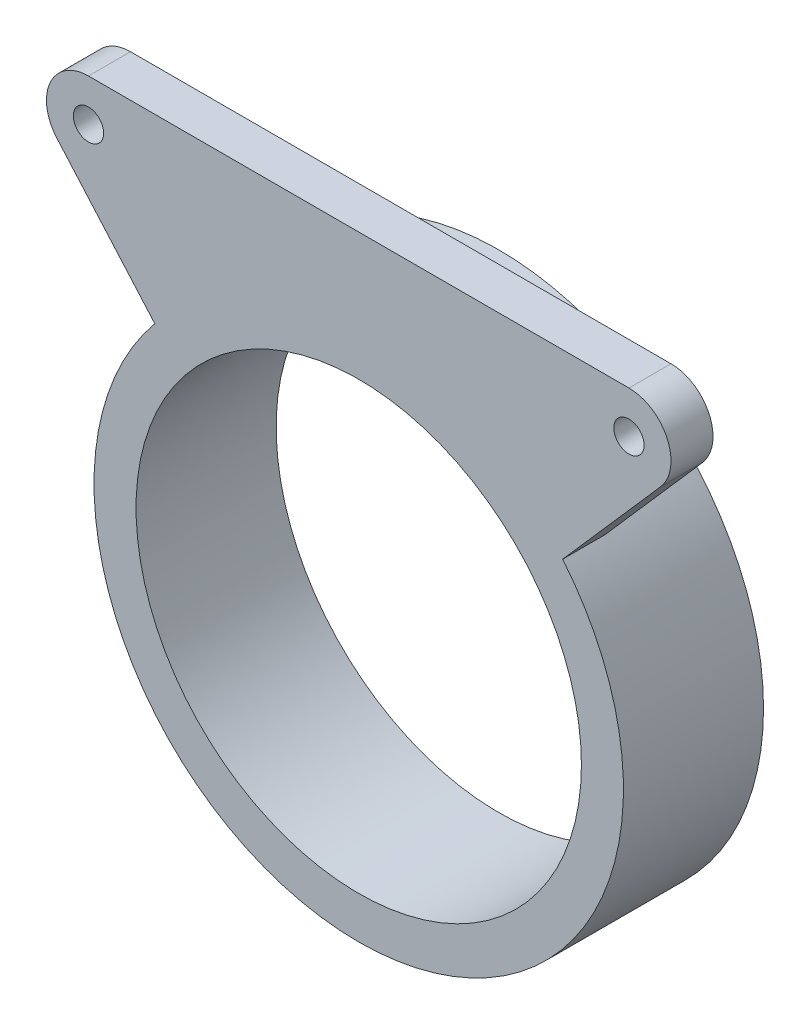
ISO-10303-21;
HEADER;
FILE_DESCRIPTION(('STEP AP214'),'2;1');
FILE_NAME('part.step','',(''),(''),'','','');
FILE_SCHEMA(('AUTOMOTIVE_DESIGN { 1 0 10303 214 1 1 1 1 }'));
ENDSEC;
DATA;
#1=APPLICATION_CONTEXT('core data for automotive mechanical design processes');
#2=APPLICATION_PROTOCOL_DEFINITION('international standard','automotive_design',2000,#1);
#3=PRODUCT_CONTEXT('',#1,'mechanical');
#4=PRODUCT('Part','Part','',(#3));
#5=PRODUCT_RELATED_PRODUCT_CATEGORY('part','',(#4));
#6=PRODUCT_DEFINITION_FORMATION('','',#4);
#7=PRODUCT_DEFINITION_CONTEXT('part definition',#1,'design');
#8=PRODUCT_DEFINITION('design','',#6,#7);
#9=PRODUCT_DEFINITION_SHAPE('','',#8);
#10=(LENGTH_UNIT() NAMED_UNIT(*) SI_UNIT(.MILLI.,.METRE.));
#11=(NAMED_UNIT(*) PLANE_ANGLE_UNIT() SI_UNIT($,.RADIAN.));
#12=(NAMED_UNIT(*) SI_UNIT($,.STERADIAN.) SOLID_ANGLE_UNIT());
#13=UNCERTAINTY_MEASURE_WITH_UNIT(LENGTH_MEASURE(1.E-05),#10,'distance_accuracy_value','');
#14=(GEOMETRIC_REPRESENTATION_CONTEXT(3) GLOBAL_UNCERTAINTY_ASSIGNED_CONTEXT((#13)) GLOBAL_UNIT_ASSIGNED_CONTEXT((#10,
#11,#12)) REPRESENTATION_CONTEXT('',''));
#15=CARTESIAN_POINT('',(0.,0.,0.));
#16=DIRECTION('',(0.,0.,1.));
#17=DIRECTION('',(1.,0.,0.));
#18=AXIS2_PLACEMENT_3D('',#15,#16,#17);
#19=CARTESIAN_POINT('',(0.,0.,12.7));
#20=DIRECTION('',(0.,0.,1.));
#21=DIRECTION('',(1.,0.,0.));
#22=AXIS2_PLACEMENT_3D('',#19,#20,#21);
#23=PLANE('',#22);
#24=CARTESIAN_POINT('',(0.,0.,12.7));
#25=DIRECTION('',(0.,0.,1.));
#26=DIRECTION('',(1.,0.,0.));
#27=AXIS2_PLACEMENT_3D('',#24,#25,#26);
#28=CIRCLE('',#27,23.999);
#29=CARTESIAN_POINT('',(-18.4865328784837,15.3035977186,12.7));
#30=VERTEX_POINT('',#29);
#31=CARTESIAN_POINT('',(18.4865328784837,15.3035977186,12.7));
#32=VERTEX_POINT('',#31);
#33=EDGE_CURVE('E11',#30,#32,#28,.T.);
#34=ORIENTED_EDGE('',*,*,#33,.T.);
#35=DIRECTION('',(0.659299748200868,0.751880204568701,0.));
#36=VECTOR('',#35,1.);
#37=CARTESIAN_POINT('',(18.4865328784837,15.3035977186,12.7));
#38=LINE('',#37,#36);
#39=CARTESIAN_POINT('',(27.3643576168352,25.4280679593547,12.7));
#40=VERTEX_POINT('',#39);
#41=EDGE_CURVE('E131',#32,#40,#38,.T.);
#42=ORIENTED_EDGE('',*,*,#41,.T.);
#43=CARTESIAN_POINT('',(24.4996940374284,27.94,12.7));
#44=DIRECTION('',(0.,0.,1.));
#45=DIRECTION('',(1.,0.,0.));
#46=AXIS2_PLACEMENT_3D('',#43,#44,#45);
#47=CIRCLE('',#46,3.81);
#48=CARTESIAN_POINT('',(24.4996940374284,31.75,12.7));
#49=VERTEX_POINT('',#48);
#50=EDGE_CURVE('E141',#40,#49,#47,.T.);
#51=ORIENTED_EDGE('',*,*,#50,.T.);
#52=DIRECTION('',(-1.,0.,0.));
#53=VECTOR('',#52,1.);
#54=CARTESIAN_POINT('',(24.4996940374284,31.75,12.7));
#55=LINE('',#54,#53);
#56=CARTESIAN_POINT('',(-24.4996940374284,31.75,12.7));
#57=VERTEX_POINT('',#56);
#58=EDGE_CURVE('E138',#49,#57,#55,.T.);
#59=ORIENTED_EDGE('',*,*,#58,.T.);
#60=CARTESIAN_POINT('',(-24.4996940374284,27.94,12.7));
#61=DIRECTION('',(0.,0.,1.));
#62=DIRECTION('',(1.,0.,0.));
#63=AXIS2_PLACEMENT_3D('',#60,#61,#62);
#64=CIRCLE('',#63,3.81);
#65=CARTESIAN_POINT('',(-27.3643576168352,25.4280679593547,12.7));
#66=VERTEX_POINT('',#65);
#67=EDGE_CURVE('E136',#57,#66,#64,.T.);
#68=ORIENTED_EDGE('',*,*,#67,.T.);
#69=DIRECTION('',(0.659299748200868,-0.751880204568701,0.));
#70=VECTOR('',#69,1.);
#71=CARTESIAN_POINT('',(-27.3643576168352,25.4280679593547,12.7));
#72=LINE('',#71,#70);
#73=EDGE_CURVE('E46',#66,#30,#72,.T.);
#74=ORIENTED_EDGE('',*,*,#73,.T.);
#75=EDGE_LOOP('',(#34,#42,#51,#59,#68,#74));
#76=FACE_BOUND('',#75,.T.);
#77=CARTESIAN_POINT('',(0.,0.,12.7));
#78=DIRECTION('',(0.,0.,1.));
#79=DIRECTION('',(1.,0.,0.));
#80=AXIS2_PLACEMENT_3D('',#77,#78,#79);
#81=CIRCLE('',#80,20.189);
#82=CARTESIAN_POINT('',(20.189,0.,12.7));
#83=VERTEX_POINT('',#82);
#84=EDGE_CURVE('E123',#83,#83,#81,.T.);
#85=ORIENTED_EDGE('',*,*,#84,.F.);
#86=EDGE_LOOP('',(#85));
#87=FACE_BOUND('',#86,.T.);
#88=CARTESIAN_POINT('',(24.4996940374284,27.94,12.7));
#89=DIRECTION('',(0.,0.,1.));
#90=DIRECTION('',(1.,0.,0.));
#91=AXIS2_PLACEMENT_3D('',#88,#89,#90);
#92=CIRCLE('',#91,1.37499852);
#93=CARTESIAN_POINT('',(25.8746925574284,27.94,12.7));
#94=VERTEX_POINT('',#93);
#95=EDGE_CURVE('E156',#94,#94,#92,.T.);
#96=ORIENTED_EDGE('',*,*,#95,.F.);
#97=EDGE_LOOP('',(#96));
#98=FACE_BOUND('',#97,.T.);
#99=CARTESIAN_POINT('',(-24.4996940374284,27.94,12.7));
#100=DIRECTION('',(0.,0.,1.));
#101=DIRECTION('',(1.,0.,0.));
#102=AXIS2_PLACEMENT_3D('',#99,#100,#101);
#103=CIRCLE('',#102,1.37499851999997);
#104=CARTESIAN_POINT('',(-23.1246955174284,27.94,12.7));
#105=VERTEX_POINT('',#104);
#106=EDGE_CURVE('E150',#105,#105,#103,.T.);
#107=ORIENTED_EDGE('',*,*,#106,.F.);
#108=EDGE_LOOP('',(#107));
#109=FACE_BOUND('',#108,.T.);
#110=ADVANCED_FACE('F32',(#76,#87,#98,#109),#23,.T.);
#111=CARTESIAN_POINT('',(0.,0.,0.));
#112=DIRECTION('',(0.,0.,1.));
#113=DIRECTION('',(1.,0.,0.));
#114=AXIS2_PLACEMENT_3D('',#111,#112,#113);
#115=PLANE('',#114);
#116=CARTESIAN_POINT('',(0.,0.,0.));
#117=DIRECTION('',(0.,0.,1.));
#118=DIRECTION('',(1.,0.,0.));
#119=AXIS2_PLACEMENT_3D('',#116,#117,#118);
#120=CIRCLE('',#119,23.999);
#121=CARTESIAN_POINT('',(23.999,0.,0.));
#122=VERTEX_POINT('',#121);
#123=EDGE_CURVE('E36',#122,#122,#120,.T.);
#124=ORIENTED_EDGE('',*,*,#123,.F.);
#125=EDGE_LOOP('',(#124));
#126=FACE_BOUND('',#125,.T.);
#127=CARTESIAN_POINT('',(0.,0.,0.));
#128=DIRECTION('',(0.,0.,1.));
#129=DIRECTION('',(1.,0.,0.));
#130=AXIS2_PLACEMENT_3D('',#127,#128,#129);
#131=CIRCLE('',#130,20.189);
#132=CARTESIAN_POINT('',(20.189,0.,0.));
#133=VERTEX_POINT('',#132);
#134=EDGE_CURVE('E126',#133,#133,#131,.T.);
#135=ORIENTED_EDGE('',*,*,#134,.T.);
#136=EDGE_LOOP('',(#135));
#137=FACE_BOUND('',#136,.T.);
#138=ADVANCED_FACE('F173',(#126,#137),#115,.F.);
#139=CARTESIAN_POINT('',(0.,0.,12.7));
#140=DIRECTION('',(0.,0.,-1.));
#141=DIRECTION('',(-1.,0.,0.));
#142=AXIS2_PLACEMENT_3D('',#139,#140,#141);
#143=CYLINDRICAL_SURFACE('',#142,23.999);
#144=CARTESIAN_POINT('',(0.,0.,8.89));
#145=DIRECTION('',(0.,0.,-1.));
#146=DIRECTION('',(-1.,0.,0.));
#147=AXIS2_PLACEMENT_3D('',#144,#145,#146);
#148=CIRCLE('',#147,23.999);
#149=CARTESIAN_POINT('',(-18.4865328784837,15.3035977186,8.89));
#150=VERTEX_POINT('',#149);
#151=CARTESIAN_POINT('',(18.4865328784837,15.3035977186,8.89));
#152=VERTEX_POINT('',#151);
#153=EDGE_CURVE('E95',#150,#152,#148,.T.);
#154=ORIENTED_EDGE('',*,*,#153,.T.);
#155=DIRECTION('',(0.,0.,1.));
#156=VECTOR('',#155,1.);
#157=CARTESIAN_POINT('',(18.4865328784837,15.3035977186,8.89));
#158=LINE('',#157,#156);
#159=EDGE_CURVE('E114',#152,#32,#158,.T.);
#160=ORIENTED_EDGE('',*,*,#159,.T.);
#161=ORIENTED_EDGE('',*,*,#33,.F.);
#162=DIRECTION('',(0.,0.,1.));
#163=VECTOR('',#162,1.);
#164=CARTESIAN_POINT('',(-18.4865328784837,15.3035977186,8.89));
#165=LINE('',#164,#163);
#166=EDGE_CURVE('E108',#150,#30,#165,.T.);
#167=ORIENTED_EDGE('',*,*,#166,.F.);
#168=EDGE_LOOP('',(#154,#160,#161,#167));
#169=FACE_BOUND('',#168,.T.);
#170=ORIENTED_EDGE('',*,*,#123,.T.);
#171=EDGE_LOOP('',(#170));
#172=FACE_BOUND('',#171,.T.);
#173=ADVANCED_FACE('F34',(#169,#172),#143,.T.);
#174=CARTESIAN_POINT('',(0.,0.,12.7));
#175=DIRECTION('',(0.,0.,-1.));
#176=DIRECTION('',(-1.,0.,0.));
#177=AXIS2_PLACEMENT_3D('',#174,#175,#176);
#178=CYLINDRICAL_SURFACE('',#177,20.189);
#179=ORIENTED_EDGE('',*,*,#84,.T.);
#180=EDGE_LOOP('',(#179));
#181=FACE_BOUND('',#180,.T.);
#182=ORIENTED_EDGE('',*,*,#134,.F.);
#183=EDGE_LOOP('',(#182));
#184=FACE_BOUND('',#183,.T.);
#185=ADVANCED_FACE('F201',(#181,#184),#178,.F.);
#186=CARTESIAN_POINT('',(24.4996940374284,27.94,8.89));
#187=DIRECTION('',(0.,0.,1.));
#188=DIRECTION('',(1.,0.,0.));
#189=AXIS2_PLACEMENT_3D('',#186,#187,#188);
#190=CYLINDRICAL_SURFACE('',#189,3.81);
#191=ORIENTED_EDGE('',*,*,#50,.F.);
#192=DIRECTION('',(0.,0.,1.));
#193=VECTOR('',#192,1.);
#194=CARTESIAN_POINT('',(27.3643576168352,25.4280679593547,8.89));
#195=LINE('',#194,#193);
#196=CARTESIAN_POINT('',(27.3643576168352,25.4280679593547,8.89));
#197=VERTEX_POINT('',#196);
#198=EDGE_CURVE('E55',#197,#40,#195,.T.);
#199=ORIENTED_EDGE('',*,*,#198,.F.);
#200=CARTESIAN_POINT('',(24.4996940374284,27.94,8.89));
#201=DIRECTION('',(0.,0.,1.));
#202=DIRECTION('',(1.,0.,0.));
#203=AXIS2_PLACEMENT_3D('',#200,#201,#202);
#204=CIRCLE('',#203,3.81);
#205=CARTESIAN_POINT('',(24.4996940374284,31.75,8.89));
#206=VERTEX_POINT('',#205);
#207=EDGE_CURVE('E134',#197,#206,#204,.T.);
#208=ORIENTED_EDGE('',*,*,#207,.T.);
#209=DIRECTION('',(0.,0.,1.));
#210=VECTOR('',#209,1.);
#211=CARTESIAN_POINT('',(24.4996940374284,31.75,8.89));
#212=LINE('',#211,#210);
#213=EDGE_CURVE('E83',#206,#49,#212,.T.);
#214=ORIENTED_EDGE('',*,*,#213,.T.);
#215=EDGE_LOOP('',(#191,#199,#208,#214));
#216=FACE_BOUND('',#215,.T.);
#217=ADVANCED_FACE('F190',(#216),#190,.T.);
#218=CARTESIAN_POINT('',(18.4865328784837,15.3035977186,8.89));
#219=DIRECTION('',(0.751880204568701,-0.659299748200868,0.));
#220=DIRECTION('',(0.659299748200868,0.751880204568701,0.));
#221=AXIS2_PLACEMENT_3D('',#218,#219,#220);
#222=PLANE('',#221);
#223=ORIENTED_EDGE('',*,*,#41,.F.);
#224=ORIENTED_EDGE('',*,*,#159,.F.);
#225=DIRECTION('',(0.659299748200868,0.751880204568701,0.));
#226=VECTOR('',#225,1.);
#227=CARTESIAN_POINT('',(18.4865328784837,15.3035977186,8.89));
#228=LINE('',#227,#226);
#229=EDGE_CURVE('E101',#152,#197,#228,.T.);
#230=ORIENTED_EDGE('',*,*,#229,.T.);
#231=ORIENTED_EDGE('',*,*,#198,.T.);
#232=EDGE_LOOP('',(#223,#224,#230,#231));
#233=FACE_BOUND('',#232,.T.);
#234=ADVANCED_FACE('F187',(#233),#222,.T.);
#235=CARTESIAN_POINT('',(-27.3643576168352,25.4280679593547,8.89));
#236=DIRECTION('',(-0.751880204568701,-0.659299748200868,0.));
#237=DIRECTION('',(0.659299748200868,-0.751880204568701,0.));
#238=AXIS2_PLACEMENT_3D('',#235,#236,#237);
#239=PLANE('',#238);
#240=ORIENTED_EDGE('',*,*,#73,.F.);
#241=DIRECTION('',(0.,0.,1.));
#242=VECTOR('',#241,1.);
#243=CARTESIAN_POINT('',(-27.3643576168352,25.4280679593547,8.89));
#244=LINE('',#243,#242);
#245=CARTESIAN_POINT('',(-27.3643576168352,25.4280679593547,8.89));
#246=VERTEX_POINT('',#245);
#247=EDGE_CURVE('E110',#246,#66,#244,.T.);
#248=ORIENTED_EDGE('',*,*,#247,.F.);
#249=DIRECTION('',(0.659299748200868,-0.751880204568701,0.));
#250=VECTOR('',#249,1.);
#251=CARTESIAN_POINT('',(-27.3643576168352,25.4280679593547,8.89));
#252=LINE('',#251,#250);
#253=EDGE_CURVE('E99',#246,#150,#252,.T.);
#254=ORIENTED_EDGE('',*,*,#253,.T.);
#255=ORIENTED_EDGE('',*,*,#166,.T.);
#256=EDGE_LOOP('',(#240,#248,#254,#255));
#257=FACE_BOUND('',#256,.T.);
#258=ADVANCED_FACE('F107',(#257),#239,.T.);
#259=CARTESIAN_POINT('',(-24.4996940374284,27.94,8.89));
#260=DIRECTION('',(0.,0.,1.));
#261=DIRECTION('',(1.,0.,0.));
#262=AXIS2_PLACEMENT_3D('',#259,#260,#261);
#263=CYLINDRICAL_SURFACE('',#262,3.81);
#264=ORIENTED_EDGE('',*,*,#67,.F.);
#265=DIRECTION('',(0.,0.,1.));
#266=VECTOR('',#265,1.);
#267=CARTESIAN_POINT('',(-24.4996940374284,31.75,8.89));
#268=LINE('',#267,#266);
#269=CARTESIAN_POINT('',(-24.4996940374284,31.75,8.89));
#270=VERTEX_POINT('',#269);
#271=EDGE_CURVE('E117',#270,#57,#268,.T.);
#272=ORIENTED_EDGE('',*,*,#271,.F.);
#273=CARTESIAN_POINT('',(-24.4996940374284,27.94,8.89));
#274=DIRECTION('',(0.,0.,1.));
#275=DIRECTION('',(1.,0.,0.));
#276=AXIS2_PLACEMENT_3D('',#273,#274,#275);
#277=CIRCLE('',#276,3.81);
#278=EDGE_CURVE('E111',#270,#246,#277,.T.);
#279=ORIENTED_EDGE('',*,*,#278,.T.);
#280=ORIENTED_EDGE('',*,*,#247,.T.);
#281=EDGE_LOOP('',(#264,#272,#279,#280));
#282=FACE_BOUND('',#281,.T.);
#283=ADVANCED_FACE('F193',(#282),#263,.T.);
#284=CARTESIAN_POINT('',(24.4996940374284,31.75,8.89));
#285=DIRECTION('',(0.,1.,0.));
#286=DIRECTION('',(0.,0.,1.));
#287=AXIS2_PLACEMENT_3D('',#284,#285,#286);
#288=PLANE('',#287);
#289=ORIENTED_EDGE('',*,*,#58,.F.);
#290=ORIENTED_EDGE('',*,*,#213,.F.);
#291=DIRECTION('',(-1.,0.,0.));
#292=VECTOR('',#291,1.);
#293=CARTESIAN_POINT('',(24.4996940374284,31.75,8.89));
#294=LINE('',#293,#292);
#295=EDGE_CURVE('E147',#206,#270,#294,.T.);
#296=ORIENTED_EDGE('',*,*,#295,.T.);
#297=ORIENTED_EDGE('',*,*,#271,.T.);
#298=EDGE_LOOP('',(#289,#290,#296,#297));
#299=FACE_BOUND('',#298,.T.);
#300=ADVANCED_FACE('F183',(#299),#288,.T.);
#301=CARTESIAN_POINT('',(24.4996940374284,27.94,8.89));
#302=DIRECTION('',(0.,0.,1.));
#303=DIRECTION('',(1.,0.,0.));
#304=AXIS2_PLACEMENT_3D('',#301,#302,#303);
#305=PLANE('',#304);
#306=CARTESIAN_POINT('',(24.4996940374284,27.94,8.89));
#307=DIRECTION('',(0.,0.,1.));
#308=DIRECTION('',(1.,0.,0.));
#309=AXIS2_PLACEMENT_3D('',#306,#307,#308);
#310=CIRCLE('',#309,1.37499852);
#311=CARTESIAN_POINT('',(25.8746925574284,27.94,8.89));
#312=VERTEX_POINT('',#311);
#313=EDGE_CURVE('E153',#312,#312,#310,.T.);
#314=ORIENTED_EDGE('',*,*,#313,.T.);
#315=EDGE_LOOP('',(#314));
#316=FACE_BOUND('',#315,.T.);
#317=CARTESIAN_POINT('',(-24.4996940374284,27.94,8.89));
#318=DIRECTION('',(0.,0.,1.));
#319=DIRECTION('',(1.,0.,0.));
#320=AXIS2_PLACEMENT_3D('',#317,#318,#319);
#321=CIRCLE('',#320,1.37499851999997);
#322=CARTESIAN_POINT('',(-23.1246955174284,27.94,8.89));
#323=VERTEX_POINT('',#322);
#324=EDGE_CURVE('E144',#323,#323,#321,.T.);
#325=ORIENTED_EDGE('',*,*,#324,.T.);
#326=EDGE_LOOP('',(#325));
#327=FACE_BOUND('',#326,.T.);
#328=ORIENTED_EDGE('',*,*,#207,.F.);
#329=ORIENTED_EDGE('',*,*,#229,.F.);
#330=ORIENTED_EDGE('',*,*,#153,.F.);
#331=ORIENTED_EDGE('',*,*,#253,.F.);
#332=ORIENTED_EDGE('',*,*,#278,.F.);
#333=ORIENTED_EDGE('',*,*,#295,.F.);
#334=EDGE_LOOP('',(#328,#329,#330,#331,#332,#333));
#335=FACE_BOUND('',#334,.T.);
#336=ADVANCED_FACE('F97',(#316,#327,#335),#305,.F.);
#337=CARTESIAN_POINT('',(-24.4996940374284,27.94,8.89));
#338=DIRECTION('',(0.,0.,1.));
#339=DIRECTION('',(1.,0.,0.));
#340=AXIS2_PLACEMENT_3D('',#337,#338,#339);
#341=CYLINDRICAL_SURFACE('',#340,1.37499851999997);
#342=ORIENTED_EDGE('',*,*,#324,.F.);
#343=EDGE_LOOP('',(#342));
#344=FACE_BOUND('',#343,.T.);
#345=ORIENTED_EDGE('',*,*,#106,.T.);
#346=EDGE_LOOP('',(#345));
#347=FACE_BOUND('',#346,.T.);
#348=ADVANCED_FACE('F167',(#344,#347),#341,.F.);
#349=CARTESIAN_POINT('',(24.4996940374284,27.94,8.89));
#350=DIRECTION('',(0.,0.,1.));
#351=DIRECTION('',(1.,0.,0.));
#352=AXIS2_PLACEMENT_3D('',#349,#350,#351);
#353=CYLINDRICAL_SURFACE('',#352,1.37499852);
#354=ORIENTED_EDGE('',*,*,#313,.F.);
#355=EDGE_LOOP('',(#354));
#356=FACE_BOUND('',#355,.T.);
#357=ORIENTED_EDGE('',*,*,#95,.T.);
#358=EDGE_LOOP('',(#357));
#359=FACE_BOUND('',#358,.T.);
#360=ADVANCED_FACE('F164',(#356,#359),#353,.F.);
#361=CLOSED_SHELL('',(#110,#138,#173,#185,#217,#234,#258,#283,#300,#336,#348,#360));
#362=MANIFOLD_SOLID_BREP('B2',#361);
#363=ADVANCED_BREP_SHAPE_REPRESENTATION('',(#18,#362),#14);
#364=SHAPE_DEFINITION_REPRESENTATION(#9,#363);
ENDSEC;
END-ISO-10303-21;
